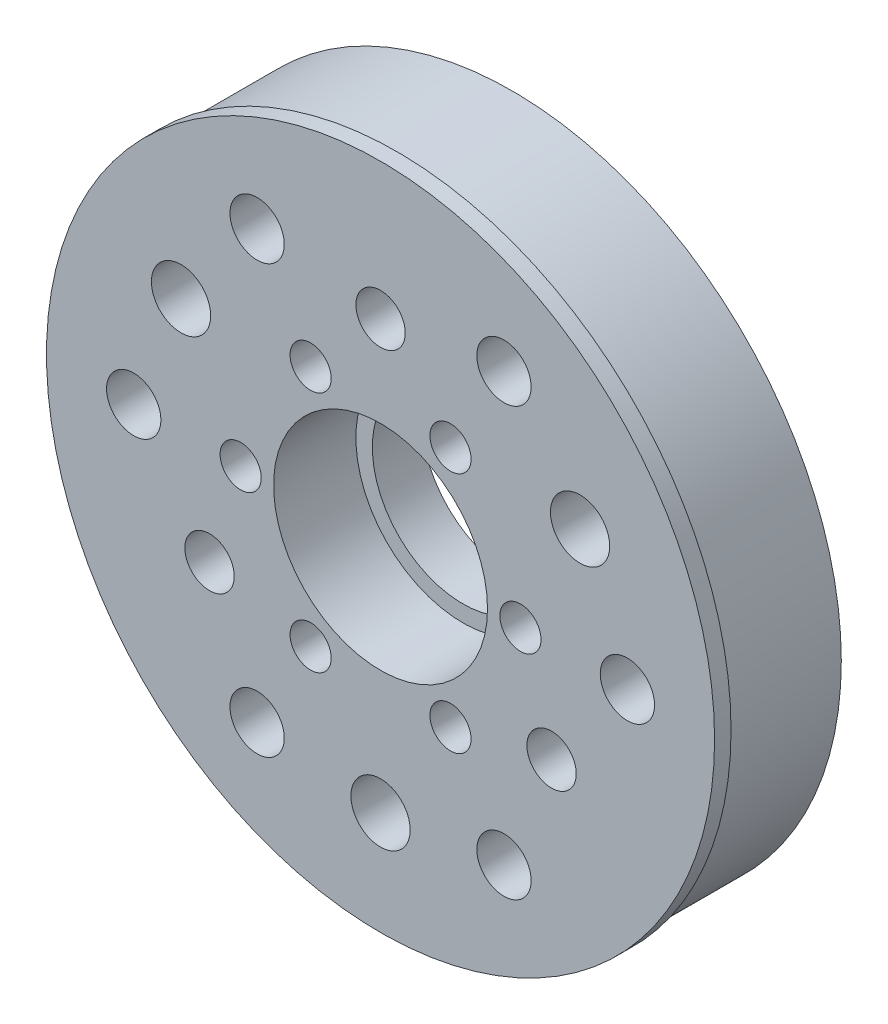
ISO-10303-21;
HEADER;
FILE_DESCRIPTION(('STEP AP214'),'2;1');
FILE_NAME('part.step','',(''),(''),'','','');
FILE_SCHEMA(('AUTOMOTIVE_DESIGN { 1 0 10303 214 1 1 1 1 }'));
ENDSEC;
DATA;
#1=APPLICATION_CONTEXT('core data for automotive mechanical design processes');
#2=APPLICATION_PROTOCOL_DEFINITION('international standard','automotive_design',2000,#1);
#3=PRODUCT_CONTEXT('',#1,'mechanical');
#4=PRODUCT('Part','Part','',(#3));
#5=PRODUCT_RELATED_PRODUCT_CATEGORY('part','',(#4));
#6=PRODUCT_DEFINITION_FORMATION('','',#4);
#7=PRODUCT_DEFINITION_CONTEXT('part definition',#1,'design');
#8=PRODUCT_DEFINITION('design','',#6,#7);
#9=PRODUCT_DEFINITION_SHAPE('','',#8);
#10=(LENGTH_UNIT() NAMED_UNIT(*) SI_UNIT(.MILLI.,.METRE.));
#11=(NAMED_UNIT(*) PLANE_ANGLE_UNIT() SI_UNIT($,.RADIAN.));
#12=(NAMED_UNIT(*) SI_UNIT($,.STERADIAN.) SOLID_ANGLE_UNIT());
#13=UNCERTAINTY_MEASURE_WITH_UNIT(LENGTH_MEASURE(1.E-05),#10,'distance_accuracy_value','');
#14=(GEOMETRIC_REPRESENTATION_CONTEXT(3) GLOBAL_UNCERTAINTY_ASSIGNED_CONTEXT((#13)) GLOBAL_UNIT_ASSIGNED_CONTEXT((#10,
#11,#12)) REPRESENTATION_CONTEXT('',''));
#15=CARTESIAN_POINT('',(0.,0.,0.));
#16=DIRECTION('',(0.,0.,1.));
#17=DIRECTION('',(1.,0.,0.));
#18=AXIS2_PLACEMENT_3D('',#15,#16,#17);
#19=CARTESIAN_POINT('',(0.,0.,0.));
#20=DIRECTION('',(0.,0.,1.));
#21=DIRECTION('',(1.,0.,0.));
#22=AXIS2_PLACEMENT_3D('',#19,#20,#21);
#23=PLANE('',#22);
#24=CARTESIAN_POINT('',(-4.25000000000009,7.36121593216768,0.));
#25=DIRECTION('',(0.,0.,-1.));
#26=DIRECTION('',(-1.,0.,0.));
#27=AXIS2_PLACEMENT_3D('',#24,#25,#26);
#28=CIRCLE('',#27,1.25);
#29=CARTESIAN_POINT('',(-5.50000000000008,7.36121593216768,0.));
#30=VERTEX_POINT('',#29);
#31=EDGE_CURVE('E119',#30,#30,#28,.T.);
#32=ORIENTED_EDGE('',*,*,#31,.F.);
#33=EDGE_LOOP('',(#32));
#34=FACE_BOUND('',#33,.T.);
#35=CARTESIAN_POINT('',(8.5,0.,0.));
#36=DIRECTION('',(0.,0.,-1.));
#37=DIRECTION('',(-1.,0.,0.));
#38=AXIS2_PLACEMENT_3D('',#35,#36,#37);
#39=CIRCLE('',#38,1.25);
#40=CARTESIAN_POINT('',(7.25,0.,0.));
#41=VERTEX_POINT('',#40);
#42=EDGE_CURVE('E123',#41,#41,#39,.T.);
#43=ORIENTED_EDGE('',*,*,#42,.F.);
#44=EDGE_LOOP('',(#43));
#45=FACE_BOUND('',#44,.T.);
#46=CARTESIAN_POINT('',(4.25000000000003,-7.36121593216771,0.));
#47=DIRECTION('',(0.,0.,-1.));
#48=DIRECTION('',(-1.,0.,0.));
#49=AXIS2_PLACEMENT_3D('',#46,#47,#48);
#50=CIRCLE('',#49,1.25);
#51=CARTESIAN_POINT('',(3.00000000000004,-7.36121593216771,0.));
#52=VERTEX_POINT('',#51);
#53=EDGE_CURVE('E127',#52,#52,#50,.T.);
#54=ORIENTED_EDGE('',*,*,#53,.F.);
#55=EDGE_LOOP('',(#54));
#56=FACE_BOUND('',#55,.T.);
#57=CARTESIAN_POINT('',(-4.24999999999998,-7.36121593216774,0.));
#58=DIRECTION('',(0.,0.,-1.));
#59=DIRECTION('',(-1.,0.,0.));
#60=AXIS2_PLACEMENT_3D('',#57,#58,#59);
#61=CIRCLE('',#60,1.25);
#62=CARTESIAN_POINT('',(-5.49999999999998,-7.36121593216774,0.));
#63=VERTEX_POINT('',#62);
#64=EDGE_CURVE('E131',#63,#63,#61,.T.);
#65=ORIENTED_EDGE('',*,*,#64,.F.);
#66=EDGE_LOOP('',(#65));
#67=FACE_BOUND('',#66,.T.);
#68=CARTESIAN_POINT('',(-7.50000000000015,12.9903810567665,0.));
#69=DIRECTION('',(0.,0.,-1.));
#70=DIRECTION('',(-1.,0.,0.));
#71=AXIS2_PLACEMENT_3D('',#68,#69,#70);
#72=CIRCLE('',#71,1.65);
#73=CARTESIAN_POINT('',(-9.15000000000015,12.9903810567665,0.));
#74=VERTEX_POINT('',#73);
#75=EDGE_CURVE('E135',#74,#74,#72,.T.);
#76=ORIENTED_EDGE('',*,*,#75,.F.);
#77=EDGE_LOOP('',(#76));
#78=FACE_BOUND('',#77,.T.);
#79=CARTESIAN_POINT('',(7.49999999999988,12.9903810567666,0.));
#80=DIRECTION('',(0.,0.,-1.));
#81=DIRECTION('',(-1.,0.,0.));
#82=AXIS2_PLACEMENT_3D('',#79,#80,#81);
#83=CIRCLE('',#82,1.65);
#84=CARTESIAN_POINT('',(5.84999999999988,12.9903810567666,0.));
#85=VERTEX_POINT('',#84);
#86=EDGE_CURVE('E139',#85,#85,#83,.T.);
#87=ORIENTED_EDGE('',*,*,#86,.F.);
#88=EDGE_LOOP('',(#87));
#89=FACE_BOUND('',#88,.T.);
#90=CARTESIAN_POINT('',(15.,0.,0.));
#91=DIRECTION('',(0.,0.,-1.));
#92=DIRECTION('',(-1.,0.,0.));
#93=AXIS2_PLACEMENT_3D('',#90,#91,#92);
#94=CIRCLE('',#93,1.65);
#95=CARTESIAN_POINT('',(13.35,0.,0.));
#96=VERTEX_POINT('',#95);
#97=EDGE_CURVE('E143',#96,#96,#94,.T.);
#98=ORIENTED_EDGE('',*,*,#97,.F.);
#99=EDGE_LOOP('',(#98));
#100=FACE_BOUND('',#99,.T.);
#101=CARTESIAN_POINT('',(7.50000000000006,-12.9903810567665,0.));
#102=DIRECTION('',(0.,0.,-1.));
#103=DIRECTION('',(-1.,0.,0.));
#104=AXIS2_PLACEMENT_3D('',#101,#102,#103);
#105=CIRCLE('',#104,1.65);
#106=CARTESIAN_POINT('',(5.85000000000006,-12.9903810567665,0.));
#107=VERTEX_POINT('',#106);
#108=EDGE_CURVE('E147',#107,#107,#105,.T.);
#109=ORIENTED_EDGE('',*,*,#108,.F.);
#110=EDGE_LOOP('',(#109));
#111=FACE_BOUND('',#110,.T.);
#112=CARTESIAN_POINT('',(-7.49999999999997,-12.9903810567666,0.));
#113=DIRECTION('',(0.,0.,-1.));
#114=DIRECTION('',(-1.,0.,0.));
#115=AXIS2_PLACEMENT_3D('',#112,#113,#114);
#116=CIRCLE('',#115,1.65);
#117=CARTESIAN_POINT('',(-9.14999999999997,-12.9903810567666,0.));
#118=VERTEX_POINT('',#117);
#119=EDGE_CURVE('E151',#118,#118,#116,.T.);
#120=ORIENTED_EDGE('',*,*,#119,.F.);
#121=EDGE_LOOP('',(#120));
#122=FACE_BOUND('',#121,.T.);
#123=CARTESIAN_POINT('',(-8.5,0.,0.));
#124=DIRECTION('',(0.,0.,-1.));
#125=DIRECTION('',(-1.,0.,0.));
#126=AXIS2_PLACEMENT_3D('',#123,#124,#125);
#127=CIRCLE('',#126,1.25);
#128=CARTESIAN_POINT('',(-9.75,0.,0.));
#129=VERTEX_POINT('',#128);
#130=EDGE_CURVE('E155',#129,#129,#127,.T.);
#131=ORIENTED_EDGE('',*,*,#130,.F.);
#132=EDGE_LOOP('',(#131));
#133=FACE_BOUND('',#132,.T.);
#134=CARTESIAN_POINT('',(-15.,0.,0.));
#135=DIRECTION('',(0.,0.,-1.));
#136=DIRECTION('',(-1.,0.,0.));
#137=AXIS2_PLACEMENT_3D('',#134,#135,#136);
#138=CIRCLE('',#137,1.65);
#139=CARTESIAN_POINT('',(-16.65,0.,0.));
#140=VERTEX_POINT('',#139);
#141=EDGE_CURVE('E159',#140,#140,#138,.T.);
#142=ORIENTED_EDGE('',*,*,#141,.F.);
#143=EDGE_LOOP('',(#142));
#144=FACE_BOUND('',#143,.T.);
#145=CARTESIAN_POINT('',(12.1243556529822,6.99999999999989,0.));
#146=DIRECTION('',(0.,0.,-1.));
#147=DIRECTION('',(-1.,0.,0.));
#148=AXIS2_PLACEMENT_3D('',#145,#146,#147);
#149=CIRCLE('',#148,3.15);
#150=CARTESIAN_POINT('',(8.97435565298221,6.99999999999989,0.));
#151=VERTEX_POINT('',#150);
#152=EDGE_CURVE('E163',#151,#151,#149,.T.);
#153=ORIENTED_EDGE('',*,*,#152,.F.);
#154=EDGE_LOOP('',(#153));
#155=FACE_BOUND('',#154,.T.);
#156=CARTESIAN_POINT('',(-12.1243556529821,7.00000000000006,0.));
#157=DIRECTION('',(0.,0.,-1.));
#158=DIRECTION('',(-1.,0.,0.));
#159=AXIS2_PLACEMENT_3D('',#156,#157,#158);
#160=CIRCLE('',#159,3.15);
#161=CARTESIAN_POINT('',(-15.2743556529821,7.00000000000006,0.));
#162=VERTEX_POINT('',#161);
#163=EDGE_CURVE('E167',#162,#162,#160,.T.);
#164=ORIENTED_EDGE('',*,*,#163,.F.);
#165=EDGE_LOOP('',(#164));
#166=FACE_BOUND('',#165,.T.);
#167=CARTESIAN_POINT('',(0.,-14.,0.));
#168=DIRECTION('',(0.,0.,-1.));
#169=DIRECTION('',(-1.,0.,0.));
#170=AXIS2_PLACEMENT_3D('',#167,#168,#169);
#171=CIRCLE('',#170,3.15);
#172=CARTESIAN_POINT('',(-3.15,-14.,0.));
#173=VERTEX_POINT('',#172);
#174=EDGE_CURVE('E170',#173,#173,#171,.T.);
#175=ORIENTED_EDGE('',*,*,#174,.F.);
#176=EDGE_LOOP('',(#175));
#177=FACE_BOUND('',#176,.T.);
#178=CARTESIAN_POINT('',(-10.3923048454132,-6.00000000000005,0.));
#179=DIRECTION('',(0.,0.,1.));
#180=DIRECTION('',(-0.500000000000004,0.866025403784436,0.));
#181=AXIS2_PLACEMENT_3D('',#178,#179,#180);
#182=CIRCLE('',#181,1.5);
#183=CARTESIAN_POINT('',(-11.1423048454132,-4.7009618943234,0.));
#184=VERTEX_POINT('',#183);
#185=EDGE_CURVE('E60',#184,#184,#182,.T.);
#186=ORIENTED_EDGE('',*,*,#185,.T.);
#187=EDGE_LOOP('',(#186));
#188=FACE_BOUND('',#187,.T.);
#189=CARTESIAN_POINT('',(10.3923048454133,-5.9999999999999,0.));
#190=DIRECTION('',(0.,0.,1.));
#191=DIRECTION('',(-0.499999999999992,-0.866025403784443,0.));
#192=AXIS2_PLACEMENT_3D('',#189,#190,#191);
#193=CIRCLE('',#192,1.5);
#194=CARTESIAN_POINT('',(9.64230484541333,-7.29903810567657,0.));
#195=VERTEX_POINT('',#194);
#196=EDGE_CURVE('E65',#195,#195,#193,.T.);
#197=ORIENTED_EDGE('',*,*,#196,.T.);
#198=EDGE_LOOP('',(#197));
#199=FACE_BOUND('',#198,.T.);
#200=CARTESIAN_POINT('',(0.,12.,0.));
#201=DIRECTION('',(0.,0.,1.));
#202=DIRECTION('',(1.,0.,0.));
#203=AXIS2_PLACEMENT_3D('',#200,#201,#202);
#204=CIRCLE('',#203,1.5);
#205=CARTESIAN_POINT('',(1.5,12.,0.));
#206=VERTEX_POINT('',#205);
#207=EDGE_CURVE('E57',#206,#206,#204,.T.);
#208=ORIENTED_EDGE('',*,*,#207,.T.);
#209=EDGE_LOOP('',(#208));
#210=FACE_BOUND('',#209,.T.);
#211=CARTESIAN_POINT('',(0.,0.,0.));
#212=DIRECTION('',(0.,0.,1.));
#213=DIRECTION('',(1.,0.,0.));
#214=AXIS2_PLACEMENT_3D('',#211,#212,#213);
#215=CIRCLE('',#214,5.5);
#216=CARTESIAN_POINT('',(5.5,0.,0.));
#217=VERTEX_POINT('',#216);
#218=EDGE_CURVE('E77',#217,#217,#215,.T.);
#219=ORIENTED_EDGE('',*,*,#218,.T.);
#220=EDGE_LOOP('',(#219));
#221=FACE_BOUND('',#220,.T.);
#222=CARTESIAN_POINT('',(0.,0.,0.));
#223=DIRECTION('',(0.,0.,1.));
#224=DIRECTION('',(1.,0.,0.));
#225=AXIS2_PLACEMENT_3D('',#222,#223,#224);
#226=CIRCLE('',#225,20.);
#227=CARTESIAN_POINT('',(20.,0.,0.));
#228=VERTEX_POINT('',#227);
#229=EDGE_CURVE('E43',#228,#228,#226,.T.);
#230=ORIENTED_EDGE('',*,*,#229,.F.);
#231=EDGE_LOOP('',(#230));
#232=FACE_BOUND('',#231,.T.);
#233=CARTESIAN_POINT('',(4.24999999999993,7.36121593216777,0.));
#234=DIRECTION('',(0.,0.,-1.));
#235=DIRECTION('',(-1.,0.,0.));
#236=AXIS2_PLACEMENT_3D('',#233,#234,#235);
#237=CIRCLE('',#236,1.25);
#238=CARTESIAN_POINT('',(2.99999999999993,7.36121593216777,0.));
#239=VERTEX_POINT('',#238);
#240=EDGE_CURVE('E182',#239,#239,#237,.T.);
#241=ORIENTED_EDGE('',*,*,#240,.F.);
#242=EDGE_LOOP('',(#241));
#243=FACE_BOUND('',#242,.T.);
#244=ADVANCED_FACE('F35',(#34,#45,#56,#67,#78,#89,#100,#111,#122,#133,#144,#155,#166,#177,#188,
#199,#210,#221,#232,#243),#23,.F.);
#245=CARTESIAN_POINT('',(0.,0.,8.));
#246=DIRECTION('',(0.,0.,1.));
#247=DIRECTION('',(1.,0.,0.));
#248=AXIS2_PLACEMENT_3D('',#245,#246,#247);
#249=PLANE('',#248);
#250=CARTESIAN_POINT('',(-4.25000000000009,7.36121593216768,8.));
#251=DIRECTION('',(0.,0.,-1.));
#252=DIRECTION('',(-1.,0.,0.));
#253=AXIS2_PLACEMENT_3D('',#250,#251,#252);
#254=CIRCLE('',#253,1.25);
#255=CARTESIAN_POINT('',(-5.50000000000008,7.36121593216768,8.));
#256=VERTEX_POINT('',#255);
#257=EDGE_CURVE('E185',#256,#256,#254,.T.);
#258=ORIENTED_EDGE('',*,*,#257,.T.);
#259=EDGE_LOOP('',(#258));
#260=FACE_BOUND('',#259,.T.);
#261=CARTESIAN_POINT('',(4.24999999999993,7.36121593216777,8.));
#262=DIRECTION('',(0.,0.,-1.));
#263=DIRECTION('',(-1.,0.,0.));
#264=AXIS2_PLACEMENT_3D('',#261,#262,#263);
#265=CIRCLE('',#264,1.25);
#266=CARTESIAN_POINT('',(2.99999999999993,7.36121593216777,8.));
#267=VERTEX_POINT('',#266);
#268=EDGE_CURVE('E184',#267,#267,#265,.T.);
#269=ORIENTED_EDGE('',*,*,#268,.T.);
#270=EDGE_LOOP('',(#269));
#271=FACE_BOUND('',#270,.T.);
#272=CARTESIAN_POINT('',(8.5,0.,8.));
#273=DIRECTION('',(0.,0.,-1.));
#274=DIRECTION('',(-1.,0.,0.));
#275=AXIS2_PLACEMENT_3D('',#272,#273,#274);
#276=CIRCLE('',#275,1.25);
#277=CARTESIAN_POINT('',(7.25,0.,8.));
#278=VERTEX_POINT('',#277);
#279=EDGE_CURVE('E194',#278,#278,#276,.T.);
#280=ORIENTED_EDGE('',*,*,#279,.T.);
#281=EDGE_LOOP('',(#280));
#282=FACE_BOUND('',#281,.T.);
#283=CARTESIAN_POINT('',(4.25000000000003,-7.36121593216771,8.));
#284=DIRECTION('',(0.,0.,-1.));
#285=DIRECTION('',(-1.,0.,0.));
#286=AXIS2_PLACEMENT_3D('',#283,#284,#285);
#287=CIRCLE('',#286,1.25);
#288=CARTESIAN_POINT('',(3.00000000000004,-7.36121593216771,8.));
#289=VERTEX_POINT('',#288);
#290=EDGE_CURVE('E198',#289,#289,#287,.T.);
#291=ORIENTED_EDGE('',*,*,#290,.T.);
#292=EDGE_LOOP('',(#291));
#293=FACE_BOUND('',#292,.T.);
#294=CARTESIAN_POINT('',(0.,0.,8.));
#295=DIRECTION('',(0.,0.,1.));
#296=DIRECTION('',(1.,0.,0.));
#297=AXIS2_PLACEMENT_3D('',#294,#295,#296);
#298=CIRCLE('',#297,20.3);
#299=CARTESIAN_POINT('',(20.3,0.,8.));
#300=VERTEX_POINT('',#299);
#301=EDGE_CURVE('E48',#300,#300,#298,.T.);
#302=ORIENTED_EDGE('',*,*,#301,.T.);
#303=EDGE_LOOP('',(#302));
#304=FACE_BOUND('',#303,.T.);
#305=CARTESIAN_POINT('',(0.,0.,8.));
#306=DIRECTION('',(0.,0.,1.));
#307=DIRECTION('',(1.,0.,0.));
#308=AXIS2_PLACEMENT_3D('',#305,#306,#307);
#309=CIRCLE('',#308,6.5);
#310=CARTESIAN_POINT('',(6.5,0.,8.));
#311=VERTEX_POINT('',#310);
#312=EDGE_CURVE('E80',#311,#311,#309,.T.);
#313=ORIENTED_EDGE('',*,*,#312,.F.);
#314=EDGE_LOOP('',(#313));
#315=FACE_BOUND('',#314,.T.);
#316=CARTESIAN_POINT('',(0.,12.,8.));
#317=DIRECTION('',(0.,0.,1.));
#318=DIRECTION('',(1.,0.,0.));
#319=AXIS2_PLACEMENT_3D('',#316,#317,#318);
#320=CIRCLE('',#319,1.5);
#321=CARTESIAN_POINT('',(1.5,12.,8.));
#322=VERTEX_POINT('',#321);
#323=EDGE_CURVE('E54',#322,#322,#320,.T.);
#324=ORIENTED_EDGE('',*,*,#323,.F.);
#325=EDGE_LOOP('',(#324));
#326=FACE_BOUND('',#325,.T.);
#327=CARTESIAN_POINT('',(10.3923048454133,-5.9999999999999,8.));
#328=DIRECTION('',(0.,0.,1.));
#329=DIRECTION('',(1.,0.,0.));
#330=AXIS2_PLACEMENT_3D('',#327,#328,#329);
#331=CIRCLE('',#330,1.5);
#332=CARTESIAN_POINT('',(11.8923048454133,-5.9999999999999,8.));
#333=VERTEX_POINT('',#332);
#334=EDGE_CURVE('E58',#333,#333,#331,.T.);
#335=ORIENTED_EDGE('',*,*,#334,.F.);
#336=EDGE_LOOP('',(#335));
#337=FACE_BOUND('',#336,.T.);
#338=CARTESIAN_POINT('',(-10.3923048454132,-6.00000000000005,8.));
#339=DIRECTION('',(0.,0.,1.));
#340=DIRECTION('',(1.,0.,0.));
#341=AXIS2_PLACEMENT_3D('',#338,#339,#340);
#342=CIRCLE('',#341,1.5);
#343=CARTESIAN_POINT('',(-8.89230484541324,-6.00000000000005,8.));
#344=VERTEX_POINT('',#343);
#345=EDGE_CURVE('E39',#344,#344,#342,.T.);
#346=ORIENTED_EDGE('',*,*,#345,.F.);
#347=EDGE_LOOP('',(#346));
#348=FACE_BOUND('',#347,.T.);
#349=CARTESIAN_POINT('',(0.,-14.,8.));
#350=DIRECTION('',(0.,0.,-1.));
#351=DIRECTION('',(-1.,0.,0.));
#352=AXIS2_PLACEMENT_3D('',#349,#350,#351);
#353=CIRCLE('',#352,1.8);
#354=CARTESIAN_POINT('',(-1.8,-14.,8.));
#355=VERTEX_POINT('',#354);
#356=EDGE_CURVE('E70',#355,#355,#353,.T.);
#357=ORIENTED_EDGE('',*,*,#356,.T.);
#358=EDGE_LOOP('',(#357));
#359=FACE_BOUND('',#358,.T.);
#360=CARTESIAN_POINT('',(-12.1243556529821,7.00000000000006,8.));
#361=DIRECTION('',(0.,0.,-1.));
#362=DIRECTION('',(-1.,0.,0.));
#363=AXIS2_PLACEMENT_3D('',#360,#361,#362);
#364=CIRCLE('',#363,1.8);
#365=CARTESIAN_POINT('',(-13.9243556529821,7.00000000000006,8.));
#366=VERTEX_POINT('',#365);
#367=EDGE_CURVE('E244',#366,#366,#364,.T.);
#368=ORIENTED_EDGE('',*,*,#367,.T.);
#369=EDGE_LOOP('',(#368));
#370=FACE_BOUND('',#369,.T.);
#371=CARTESIAN_POINT('',(12.1243556529822,6.99999999999989,8.));
#372=DIRECTION('',(0.,0.,-1.));
#373=DIRECTION('',(-1.,0.,0.));
#374=AXIS2_PLACEMENT_3D('',#371,#372,#373);
#375=CIRCLE('',#374,1.8);
#376=CARTESIAN_POINT('',(10.3243556529822,6.99999999999989,8.));
#377=VERTEX_POINT('',#376);
#378=EDGE_CURVE('E237',#377,#377,#375,.T.);
#379=ORIENTED_EDGE('',*,*,#378,.T.);
#380=EDGE_LOOP('',(#379));
#381=FACE_BOUND('',#380,.T.);
#382=CARTESIAN_POINT('',(-15.,0.,8.));
#383=DIRECTION('',(0.,0.,-1.));
#384=DIRECTION('',(-1.,0.,0.));
#385=AXIS2_PLACEMENT_3D('',#382,#383,#384);
#386=CIRCLE('',#385,1.65);
#387=CARTESIAN_POINT('',(-16.65,0.,8.));
#388=VERTEX_POINT('',#387);
#389=EDGE_CURVE('E230',#388,#388,#386,.T.);
#390=ORIENTED_EDGE('',*,*,#389,.T.);
#391=EDGE_LOOP('',(#390));
#392=FACE_BOUND('',#391,.T.);
#393=CARTESIAN_POINT('',(-8.5,0.,8.));
#394=DIRECTION('',(0.,0.,-1.));
#395=DIRECTION('',(-1.,0.,0.));
#396=AXIS2_PLACEMENT_3D('',#393,#394,#395);
#397=CIRCLE('',#396,1.25);
#398=CARTESIAN_POINT('',(-9.75,0.,8.));
#399=VERTEX_POINT('',#398);
#400=EDGE_CURVE('E226',#399,#399,#397,.T.);
#401=ORIENTED_EDGE('',*,*,#400,.T.);
#402=EDGE_LOOP('',(#401));
#403=FACE_BOUND('',#402,.T.);
#404=CARTESIAN_POINT('',(-7.49999999999997,-12.9903810567666,8.));
#405=DIRECTION('',(0.,0.,-1.));
#406=DIRECTION('',(-1.,0.,0.));
#407=AXIS2_PLACEMENT_3D('',#404,#405,#406);
#408=CIRCLE('',#407,1.65);
#409=CARTESIAN_POINT('',(-9.14999999999997,-12.9903810567666,8.));
#410=VERTEX_POINT('',#409);
#411=EDGE_CURVE('E222',#410,#410,#408,.T.);
#412=ORIENTED_EDGE('',*,*,#411,.T.);
#413=EDGE_LOOP('',(#412));
#414=FACE_BOUND('',#413,.T.);
#415=CARTESIAN_POINT('',(7.50000000000006,-12.9903810567665,8.));
#416=DIRECTION('',(0.,0.,-1.));
#417=DIRECTION('',(-1.,0.,0.));
#418=AXIS2_PLACEMENT_3D('',#415,#416,#417);
#419=CIRCLE('',#418,1.65);
#420=CARTESIAN_POINT('',(5.85000000000006,-12.9903810567665,8.));
#421=VERTEX_POINT('',#420);
#422=EDGE_CURVE('E218',#421,#421,#419,.T.);
#423=ORIENTED_EDGE('',*,*,#422,.T.);
#424=EDGE_LOOP('',(#423));
#425=FACE_BOUND('',#424,.T.);
#426=CARTESIAN_POINT('',(15.,0.,8.));
#427=DIRECTION('',(0.,0.,-1.));
#428=DIRECTION('',(-1.,0.,0.));
#429=AXIS2_PLACEMENT_3D('',#426,#427,#428);
#430=CIRCLE('',#429,1.65);
#431=CARTESIAN_POINT('',(13.35,0.,8.));
#432=VERTEX_POINT('',#431);
#433=EDGE_CURVE('E214',#432,#432,#430,.T.);
#434=ORIENTED_EDGE('',*,*,#433,.T.);
#435=EDGE_LOOP('',(#434));
#436=FACE_BOUND('',#435,.T.);
#437=CARTESIAN_POINT('',(7.49999999999988,12.9903810567666,8.));
#438=DIRECTION('',(0.,0.,-1.));
#439=DIRECTION('',(-1.,0.,0.));
#440=AXIS2_PLACEMENT_3D('',#437,#438,#439);
#441=CIRCLE('',#440,1.65);
#442=CARTESIAN_POINT('',(5.84999999999988,12.9903810567666,8.));
#443=VERTEX_POINT('',#442);
#444=EDGE_CURVE('E210',#443,#443,#441,.T.);
#445=ORIENTED_EDGE('',*,*,#444,.T.);
#446=EDGE_LOOP('',(#445));
#447=FACE_BOUND('',#446,.T.);
#448=CARTESIAN_POINT('',(-7.50000000000015,12.9903810567665,8.));
#449=DIRECTION('',(0.,0.,-1.));
#450=DIRECTION('',(-1.,0.,0.));
#451=AXIS2_PLACEMENT_3D('',#448,#449,#450);
#452=CIRCLE('',#451,1.65);
#453=CARTESIAN_POINT('',(-9.15000000000015,12.9903810567665,8.));
#454=VERTEX_POINT('',#453);
#455=EDGE_CURVE('E206',#454,#454,#452,.T.);
#456=ORIENTED_EDGE('',*,*,#455,.T.);
#457=EDGE_LOOP('',(#456));
#458=FACE_BOUND('',#457,.T.);
#459=CARTESIAN_POINT('',(-4.24999999999998,-7.36121593216774,8.));
#460=DIRECTION('',(0.,0.,-1.));
#461=DIRECTION('',(-1.,0.,0.));
#462=AXIS2_PLACEMENT_3D('',#459,#460,#461);
#463=CIRCLE('',#462,1.25);
#464=CARTESIAN_POINT('',(-5.49999999999998,-7.36121593216774,8.));
#465=VERTEX_POINT('',#464);
#466=EDGE_CURVE('E202',#465,#465,#463,.T.);
#467=ORIENTED_EDGE('',*,*,#466,.T.);
#468=EDGE_LOOP('',(#467));
#469=FACE_BOUND('',#468,.T.);
#470=ADVANCED_FACE('F110',(#260,#271,#282,#293,#304,#315,#326,#337,#348,#359,#370,#381,#392,
#403,#414,#425,#436,#447,#458,#469),#249,.T.);
#471=CARTESIAN_POINT('',(0.,0.,7.));
#472=DIRECTION('',(0.,0.,-1.));
#473=DIRECTION('',(-1.,0.,0.));
#474=AXIS2_PLACEMENT_3D('',#471,#472,#473);
#475=CYLINDRICAL_SURFACE('',#474,20.);
#476=CARTESIAN_POINT('',(0.,0.,7.));
#477=DIRECTION('',(0.,0.,1.));
#478=DIRECTION('',(1.,0.,0.));
#479=AXIS2_PLACEMENT_3D('',#476,#477,#478);
#480=CIRCLE('',#479,20.);
#481=CARTESIAN_POINT('',(20.,0.,7.));
#482=VERTEX_POINT('',#481);
#483=EDGE_CURVE('E10',#482,#482,#480,.T.);
#484=ORIENTED_EDGE('',*,*,#483,.F.);
#485=EDGE_LOOP('',(#484));
#486=FACE_BOUND('',#485,.T.);
#487=ORIENTED_EDGE('',*,*,#229,.T.);
#488=EDGE_LOOP('',(#487));
#489=FACE_BOUND('',#488,.T.);
#490=ADVANCED_FACE('F37',(#486,#489),#475,.T.);
#491=CARTESIAN_POINT('',(0.,0.,8.));
#492=DIRECTION('',(0.,0.,-1.));
#493=DIRECTION('',(-1.,0.,0.));
#494=AXIS2_PLACEMENT_3D('',#491,#492,#493);
#495=CYLINDRICAL_SURFACE('',#494,20.3);
#496=ORIENTED_EDGE('',*,*,#301,.F.);
#497=EDGE_LOOP('',(#496));
#498=FACE_BOUND('',#497,.T.);
#499=CARTESIAN_POINT('',(0.,0.,7.));
#500=DIRECTION('',(0.,0.,1.));
#501=DIRECTION('',(1.,0.,0.));
#502=AXIS2_PLACEMENT_3D('',#499,#500,#501);
#503=CIRCLE('',#502,20.3);
#504=CARTESIAN_POINT('',(20.3,0.,7.));
#505=VERTEX_POINT('',#504);
#506=EDGE_CURVE('E51',#505,#505,#503,.T.);
#507=ORIENTED_EDGE('',*,*,#506,.T.);
#508=EDGE_LOOP('',(#507));
#509=FACE_BOUND('',#508,.T.);
#510=ADVANCED_FACE('F93',(#498,#509),#495,.T.);
#511=CARTESIAN_POINT('',(0.,0.,7.));
#512=DIRECTION('',(0.,0.,1.));
#513=DIRECTION('',(1.,0.,0.));
#514=AXIS2_PLACEMENT_3D('',#511,#512,#513);
#515=PLANE('',#514);
#516=ORIENTED_EDGE('',*,*,#483,.T.);
#517=EDGE_LOOP('',(#516));
#518=FACE_BOUND('',#517,.T.);
#519=ORIENTED_EDGE('',*,*,#506,.F.);
#520=EDGE_LOOP('',(#519));
#521=FACE_BOUND('',#520,.T.);
#522=ADVANCED_FACE('F95',(#518,#521),#515,.F.);
#523=CARTESIAN_POINT('',(0.,0.,3.));
#524=DIRECTION('',(0.,0.,1.));
#525=DIRECTION('',(1.,0.,0.));
#526=AXIS2_PLACEMENT_3D('',#523,#524,#525);
#527=CYLINDRICAL_SURFACE('',#526,6.5);
#528=CARTESIAN_POINT('',(0.,0.,3.));
#529=DIRECTION('',(0.,0.,1.));
#530=DIRECTION('',(1.,0.,0.));
#531=AXIS2_PLACEMENT_3D('',#528,#529,#530);
#532=CIRCLE('',#531,6.5);
#533=CARTESIAN_POINT('',(6.5,0.,3.));
#534=VERTEX_POINT('',#533);
#535=EDGE_CURVE('E83',#534,#534,#532,.T.);
#536=ORIENTED_EDGE('',*,*,#535,.F.);
#537=EDGE_LOOP('',(#536));
#538=FACE_BOUND('',#537,.T.);
#539=ORIENTED_EDGE('',*,*,#312,.T.);
#540=EDGE_LOOP('',(#539));
#541=FACE_BOUND('',#540,.T.);
#542=ADVANCED_FACE('F97',(#538,#541),#527,.F.);
#543=CARTESIAN_POINT('',(0.,0.,3.));
#544=DIRECTION('',(0.,0.,1.));
#545=DIRECTION('',(1.,0.,0.));
#546=AXIS2_PLACEMENT_3D('',#543,#544,#545);
#547=PLANE('',#546);
#548=CARTESIAN_POINT('',(0.,0.,3.));
#549=DIRECTION('',(0.,0.,1.));
#550=DIRECTION('',(1.,0.,0.));
#551=AXIS2_PLACEMENT_3D('',#548,#549,#550);
#552=CIRCLE('',#551,5.5);
#553=CARTESIAN_POINT('',(5.5,0.,3.));
#554=VERTEX_POINT('',#553);
#555=EDGE_CURVE('E56',#554,#554,#552,.T.);
#556=ORIENTED_EDGE('',*,*,#555,.F.);
#557=EDGE_LOOP('',(#556));
#558=FACE_BOUND('',#557,.T.);
#559=ORIENTED_EDGE('',*,*,#535,.T.);
#560=EDGE_LOOP('',(#559));
#561=FACE_BOUND('',#560,.T.);
#562=ADVANCED_FACE('F103',(#558,#561),#547,.T.);
#563=CARTESIAN_POINT('',(0.,0.,0.));
#564=DIRECTION('',(0.,0.,1.));
#565=DIRECTION('',(1.,0.,0.));
#566=AXIS2_PLACEMENT_3D('',#563,#564,#565);
#567=CYLINDRICAL_SURFACE('',#566,5.5);
#568=ORIENTED_EDGE('',*,*,#218,.F.);
#569=EDGE_LOOP('',(#568));
#570=FACE_BOUND('',#569,.T.);
#571=ORIENTED_EDGE('',*,*,#555,.T.);
#572=EDGE_LOOP('',(#571));
#573=FACE_BOUND('',#572,.T.);
#574=ADVANCED_FACE('F278',(#570,#573),#567,.F.);
#575=CARTESIAN_POINT('',(0.,12.,0.));
#576=DIRECTION('',(0.,0.,1.));
#577=DIRECTION('',(1.,0.,0.));
#578=AXIS2_PLACEMENT_3D('',#575,#576,#577);
#579=CYLINDRICAL_SURFACE('',#578,1.5);
#580=ORIENTED_EDGE('',*,*,#323,.T.);
#581=EDGE_LOOP('',(#580));
#582=FACE_BOUND('',#581,.T.);
#583=ORIENTED_EDGE('',*,*,#207,.F.);
#584=EDGE_LOOP('',(#583));
#585=FACE_BOUND('',#584,.T.);
#586=ADVANCED_FACE('F275',(#582,#585),#579,.F.);
#587=CARTESIAN_POINT('',(10.3923048454133,-5.9999999999999,0.));
#588=DIRECTION('',(0.,0.,1.));
#589=DIRECTION('',(1.,0.,0.));
#590=AXIS2_PLACEMENT_3D('',#587,#588,#589);
#591=CYLINDRICAL_SURFACE('',#590,1.5);
#592=ORIENTED_EDGE('',*,*,#334,.T.);
#593=EDGE_LOOP('',(#592));
#594=FACE_BOUND('',#593,.T.);
#595=ORIENTED_EDGE('',*,*,#196,.F.);
#596=EDGE_LOOP('',(#595));
#597=FACE_BOUND('',#596,.T.);
#598=ADVANCED_FACE('F268',(#594,#597),#591,.F.);
#599=CARTESIAN_POINT('',(-10.3923048454132,-6.00000000000005,0.));
#600=DIRECTION('',(0.,0.,1.));
#601=DIRECTION('',(1.,0.,0.));
#602=AXIS2_PLACEMENT_3D('',#599,#600,#601);
#603=CYLINDRICAL_SURFACE('',#602,1.5);
#604=ORIENTED_EDGE('',*,*,#345,.T.);
#605=EDGE_LOOP('',(#604));
#606=FACE_BOUND('',#605,.T.);
#607=ORIENTED_EDGE('',*,*,#185,.F.);
#608=EDGE_LOOP('',(#607));
#609=FACE_BOUND('',#608,.T.);
#610=ADVANCED_FACE('F259',(#606,#609),#603,.F.);
#611=CARTESIAN_POINT('',(0.,-14.,0.));
#612=DIRECTION('',(0.,0.,-1.));
#613=DIRECTION('',(-1.,0.,0.));
#614=AXIS2_PLACEMENT_3D('',#611,#612,#613);
#615=CYLINDRICAL_SURFACE('',#614,1.8);
#616=ORIENTED_EDGE('',*,*,#356,.F.);
#617=EDGE_LOOP('',(#616));
#618=FACE_BOUND('',#617,.T.);
#619=CARTESIAN_POINT('',(0.,-14.,1.35));
#620=DIRECTION('',(0.,0.,-1.));
#621=DIRECTION('',(-1.,0.,0.));
#622=AXIS2_PLACEMENT_3D('',#619,#620,#621);
#623=CIRCLE('',#622,1.8);
#624=CARTESIAN_POINT('',(-1.8,-14.,1.35));
#625=VERTEX_POINT('',#624);
#626=EDGE_CURVE('E247',#625,#625,#623,.T.);
#627=ORIENTED_EDGE('',*,*,#626,.T.);
#628=EDGE_LOOP('',(#627));
#629=FACE_BOUND('',#628,.T.);
#630=ADVANCED_FACE('F256',(#618,#629),#615,.F.);
#631=CARTESIAN_POINT('',(0.,-14.,0.));
#632=DIRECTION('',(0.,0.,-1.));
#633=DIRECTION('',(-1.,0.,0.));
#634=AXIS2_PLACEMENT_3D('',#631,#632,#633);
#635=CONICAL_SURFACE('',#634,3.15,0.785398163397449);
#636=ORIENTED_EDGE('',*,*,#626,.F.);
#637=EDGE_LOOP('',(#636));
#638=FACE_BOUND('',#637,.T.);
#639=ORIENTED_EDGE('',*,*,#174,.T.);
#640=EDGE_LOOP('',(#639));
#641=FACE_BOUND('',#640,.T.);
#642=ADVANCED_FACE('F258',(#638,#641),#635,.F.);
#643=CARTESIAN_POINT('',(-12.1243556529821,7.00000000000006,0.));
#644=DIRECTION('',(0.,0.,-1.));
#645=DIRECTION('',(-1.,0.,0.));
#646=AXIS2_PLACEMENT_3D('',#643,#644,#645);
#647=CYLINDRICAL_SURFACE('',#646,1.8);
#648=ORIENTED_EDGE('',*,*,#367,.F.);
#649=EDGE_LOOP('',(#648));
#650=FACE_BOUND('',#649,.T.);
#651=CARTESIAN_POINT('',(-12.1243556529821,7.00000000000006,1.35));
#652=DIRECTION('',(0.,0.,-1.));
#653=DIRECTION('',(-1.,0.,0.));
#654=AXIS2_PLACEMENT_3D('',#651,#652,#653);
#655=CIRCLE('',#654,1.8);
#656=CARTESIAN_POINT('',(-13.9243556529821,7.00000000000006,1.35));
#657=VERTEX_POINT('',#656);
#658=EDGE_CURVE('E241',#657,#657,#655,.T.);
#659=ORIENTED_EDGE('',*,*,#658,.T.);
#660=EDGE_LOOP('',(#659));
#661=FACE_BOUND('',#660,.T.);
#662=ADVANCED_FACE('F265',(#650,#661),#647,.F.);
#663=CARTESIAN_POINT('',(-12.1243556529821,7.00000000000006,0.));
#664=DIRECTION('',(0.,0.,-1.));
#665=DIRECTION('',(-1.,0.,0.));
#666=AXIS2_PLACEMENT_3D('',#663,#664,#665);
#667=CONICAL_SURFACE('',#666,3.15,0.785398163397449);
#668=ORIENTED_EDGE('',*,*,#658,.F.);
#669=EDGE_LOOP('',(#668));
#670=FACE_BOUND('',#669,.T.);
#671=ORIENTED_EDGE('',*,*,#163,.T.);
#672=EDGE_LOOP('',(#671));
#673=FACE_BOUND('',#672,.T.);
#674=ADVANCED_FACE('F338',(#670,#673),#667,.F.);
#675=CARTESIAN_POINT('',(12.1243556529822,6.99999999999989,0.));
#676=DIRECTION('',(0.,0.,-1.));
#677=DIRECTION('',(-1.,0.,0.));
#678=AXIS2_PLACEMENT_3D('',#675,#676,#677);
#679=CYLINDRICAL_SURFACE('',#678,1.8);
#680=ORIENTED_EDGE('',*,*,#378,.F.);
#681=EDGE_LOOP('',(#680));
#682=FACE_BOUND('',#681,.T.);
#683=CARTESIAN_POINT('',(12.1243556529822,6.99999999999989,1.35));
#684=DIRECTION('',(0.,0.,-1.));
#685=DIRECTION('',(-1.,0.,0.));
#686=AXIS2_PLACEMENT_3D('',#683,#684,#685);
#687=CIRCLE('',#686,1.8);
#688=CARTESIAN_POINT('',(10.3243556529822,6.99999999999989,1.35));
#689=VERTEX_POINT('',#688);
#690=EDGE_CURVE('E234',#689,#689,#687,.T.);
#691=ORIENTED_EDGE('',*,*,#690,.T.);
#692=EDGE_LOOP('',(#691));
#693=FACE_BOUND('',#692,.T.);
#694=ADVANCED_FACE('F347',(#682,#693),#679,.F.);
#695=CARTESIAN_POINT('',(12.1243556529822,6.99999999999989,0.));
#696=DIRECTION('',(0.,0.,-1.));
#697=DIRECTION('',(-1.,0.,0.));
#698=AXIS2_PLACEMENT_3D('',#695,#696,#697);
#699=CONICAL_SURFACE('',#698,3.15,0.785398163397449);
#700=ORIENTED_EDGE('',*,*,#690,.F.);
#701=EDGE_LOOP('',(#700));
#702=FACE_BOUND('',#701,.T.);
#703=ORIENTED_EDGE('',*,*,#152,.T.);
#704=EDGE_LOOP('',(#703));
#705=FACE_BOUND('',#704,.T.);
#706=ADVANCED_FACE('F357',(#702,#705),#699,.F.);
#707=CARTESIAN_POINT('',(-15.,0.,0.));
#708=DIRECTION('',(0.,0.,-1.));
#709=DIRECTION('',(-1.,0.,0.));
#710=AXIS2_PLACEMENT_3D('',#707,#708,#709);
#711=CYLINDRICAL_SURFACE('',#710,1.65);
#712=ORIENTED_EDGE('',*,*,#389,.F.);
#713=EDGE_LOOP('',(#712));
#714=FACE_BOUND('',#713,.T.);
#715=ORIENTED_EDGE('',*,*,#141,.T.);
#716=EDGE_LOOP('',(#715));
#717=FACE_BOUND('',#716,.T.);
#718=ADVANCED_FACE('F367',(#714,#717),#711,.F.);
#719=CARTESIAN_POINT('',(-8.5,0.,0.));
#720=DIRECTION('',(0.,0.,-1.));
#721=DIRECTION('',(-1.,0.,0.));
#722=AXIS2_PLACEMENT_3D('',#719,#720,#721);
#723=CYLINDRICAL_SURFACE('',#722,1.25);
#724=ORIENTED_EDGE('',*,*,#400,.F.);
#725=EDGE_LOOP('',(#724));
#726=FACE_BOUND('',#725,.T.);
#727=ORIENTED_EDGE('',*,*,#130,.T.);
#728=EDGE_LOOP('',(#727));
#729=FACE_BOUND('',#728,.T.);
#730=ADVANCED_FACE('F377',(#726,#729),#723,.F.);
#731=CARTESIAN_POINT('',(-7.49999999999997,-12.9903810567666,0.));
#732=DIRECTION('',(0.,0.,-1.));
#733=DIRECTION('',(-1.,0.,0.));
#734=AXIS2_PLACEMENT_3D('',#731,#732,#733);
#735=CYLINDRICAL_SURFACE('',#734,1.65);
#736=ORIENTED_EDGE('',*,*,#411,.F.);
#737=EDGE_LOOP('',(#736));
#738=FACE_BOUND('',#737,.T.);
#739=ORIENTED_EDGE('',*,*,#119,.T.);
#740=EDGE_LOOP('',(#739));
#741=FACE_BOUND('',#740,.T.);
#742=ADVANCED_FACE('F387',(#738,#741),#735,.F.);
#743=CARTESIAN_POINT('',(7.50000000000006,-12.9903810567665,0.));
#744=DIRECTION('',(0.,0.,-1.));
#745=DIRECTION('',(-1.,0.,0.));
#746=AXIS2_PLACEMENT_3D('',#743,#744,#745);
#747=CYLINDRICAL_SURFACE('',#746,1.65);
#748=ORIENTED_EDGE('',*,*,#422,.F.);
#749=EDGE_LOOP('',(#748));
#750=FACE_BOUND('',#749,.T.);
#751=ORIENTED_EDGE('',*,*,#108,.T.);
#752=EDGE_LOOP('',(#751));
#753=FACE_BOUND('',#752,.T.);
#754=ADVANCED_FACE('F412',(#750,#753),#747,.F.);
#755=CARTESIAN_POINT('',(15.,0.,0.));
#756=DIRECTION('',(0.,0.,-1.));
#757=DIRECTION('',(-1.,0.,0.));
#758=AXIS2_PLACEMENT_3D('',#755,#756,#757);
#759=CYLINDRICAL_SURFACE('',#758,1.65);
#760=ORIENTED_EDGE('',*,*,#433,.F.);
#761=EDGE_LOOP('',(#760));
#762=FACE_BOUND('',#761,.T.);
#763=ORIENTED_EDGE('',*,*,#97,.T.);
#764=EDGE_LOOP('',(#763));
#765=FACE_BOUND('',#764,.T.);
#766=ADVANCED_FACE('F422',(#762,#765),#759,.F.);
#767=CARTESIAN_POINT('',(7.49999999999988,12.9903810567666,0.));
#768=DIRECTION('',(0.,0.,-1.));
#769=DIRECTION('',(-1.,0.,0.));
#770=AXIS2_PLACEMENT_3D('',#767,#768,#769);
#771=CYLINDRICAL_SURFACE('',#770,1.65);
#772=ORIENTED_EDGE('',*,*,#444,.F.);
#773=EDGE_LOOP('',(#772));
#774=FACE_BOUND('',#773,.T.);
#775=ORIENTED_EDGE('',*,*,#86,.T.);
#776=EDGE_LOOP('',(#775));
#777=FACE_BOUND('',#776,.T.);
#778=ADVANCED_FACE('F432',(#774,#777),#771,.F.);
#779=CARTESIAN_POINT('',(-7.50000000000015,12.9903810567665,0.));
#780=DIRECTION('',(0.,0.,-1.));
#781=DIRECTION('',(-1.,0.,0.));
#782=AXIS2_PLACEMENT_3D('',#779,#780,#781);
#783=CYLINDRICAL_SURFACE('',#782,1.65);
#784=ORIENTED_EDGE('',*,*,#455,.F.);
#785=EDGE_LOOP('',(#784));
#786=FACE_BOUND('',#785,.T.);
#787=ORIENTED_EDGE('',*,*,#75,.T.);
#788=EDGE_LOOP('',(#787));
#789=FACE_BOUND('',#788,.T.);
#790=ADVANCED_FACE('F442',(#786,#789),#783,.F.);
#791=CARTESIAN_POINT('',(-4.24999999999998,-7.36121593216774,0.));
#792=DIRECTION('',(0.,0.,-1.));
#793=DIRECTION('',(-1.,0.,0.));
#794=AXIS2_PLACEMENT_3D('',#791,#792,#793);
#795=CYLINDRICAL_SURFACE('',#794,1.25);
#796=ORIENTED_EDGE('',*,*,#466,.F.);
#797=EDGE_LOOP('',(#796));
#798=FACE_BOUND('',#797,.T.);
#799=ORIENTED_EDGE('',*,*,#64,.T.);
#800=EDGE_LOOP('',(#799));
#801=FACE_BOUND('',#800,.T.);
#802=ADVANCED_FACE('F451',(#798,#801),#795,.F.);
#803=CARTESIAN_POINT('',(4.25000000000003,-7.36121593216771,0.));
#804=DIRECTION('',(0.,0.,-1.));
#805=DIRECTION('',(-1.,0.,0.));
#806=AXIS2_PLACEMENT_3D('',#803,#804,#805);
#807=CYLINDRICAL_SURFACE('',#806,1.25);
#808=ORIENTED_EDGE('',*,*,#290,.F.);
#809=EDGE_LOOP('',(#808));
#810=FACE_BOUND('',#809,.T.);
#811=ORIENTED_EDGE('',*,*,#53,.T.);
#812=EDGE_LOOP('',(#811));
#813=FACE_BOUND('',#812,.T.);
#814=ADVANCED_FACE('F461',(#810,#813),#807,.F.);
#815=CARTESIAN_POINT('',(8.5,0.,0.));
#816=DIRECTION('',(0.,0.,-1.));
#817=DIRECTION('',(-1.,0.,0.));
#818=AXIS2_PLACEMENT_3D('',#815,#816,#817);
#819=CYLINDRICAL_SURFACE('',#818,1.25);
#820=ORIENTED_EDGE('',*,*,#279,.F.);
#821=EDGE_LOOP('',(#820));
#822=FACE_BOUND('',#821,.T.);
#823=ORIENTED_EDGE('',*,*,#42,.T.);
#824=EDGE_LOOP('',(#823));
#825=FACE_BOUND('',#824,.T.);
#826=ADVANCED_FACE('F472',(#822,#825),#819,.F.);
#827=CARTESIAN_POINT('',(4.24999999999993,7.36121593216777,0.));
#828=DIRECTION('',(0.,0.,-1.));
#829=DIRECTION('',(-1.,0.,0.));
#830=AXIS2_PLACEMENT_3D('',#827,#828,#829);
#831=CYLINDRICAL_SURFACE('',#830,1.25);
#832=ORIENTED_EDGE('',*,*,#268,.F.);
#833=EDGE_LOOP('',(#832));
#834=FACE_BOUND('',#833,.T.);
#835=ORIENTED_EDGE('',*,*,#240,.T.);
#836=EDGE_LOOP('',(#835));
#837=FACE_BOUND('',#836,.T.);
#838=ADVANCED_FACE('F483',(#834,#837),#831,.F.);
#839=CARTESIAN_POINT('',(-4.25000000000009,7.36121593216768,0.));
#840=DIRECTION('',(0.,0.,-1.));
#841=DIRECTION('',(-1.,0.,0.));
#842=AXIS2_PLACEMENT_3D('',#839,#840,#841);
#843=CYLINDRICAL_SURFACE('',#842,1.25);
#844=ORIENTED_EDGE('',*,*,#257,.F.);
#845=EDGE_LOOP('',(#844));
#846=FACE_BOUND('',#845,.T.);
#847=ORIENTED_EDGE('',*,*,#31,.T.);
#848=EDGE_LOOP('',(#847));
#849=FACE_BOUND('',#848,.T.);
#850=ADVANCED_FACE('F494',(#846,#849),#843,.F.);
#851=CLOSED_SHELL('',(#244,#470,#490,#510,#522,#542,#562,#574,#586,#598,#610,#630,#642,#662,
#674,#694,#706,#718,#730,#742,#754,#766,#778,#790,#802,#814,#826,#838,#850));
#852=MANIFOLD_SOLID_BREP('B2',#851);
#853=ADVANCED_BREP_SHAPE_REPRESENTATION('',(#18,#852),#14);
#854=SHAPE_DEFINITION_REPRESENTATION(#9,#853);
ENDSEC;
END-ISO-10303-21;
